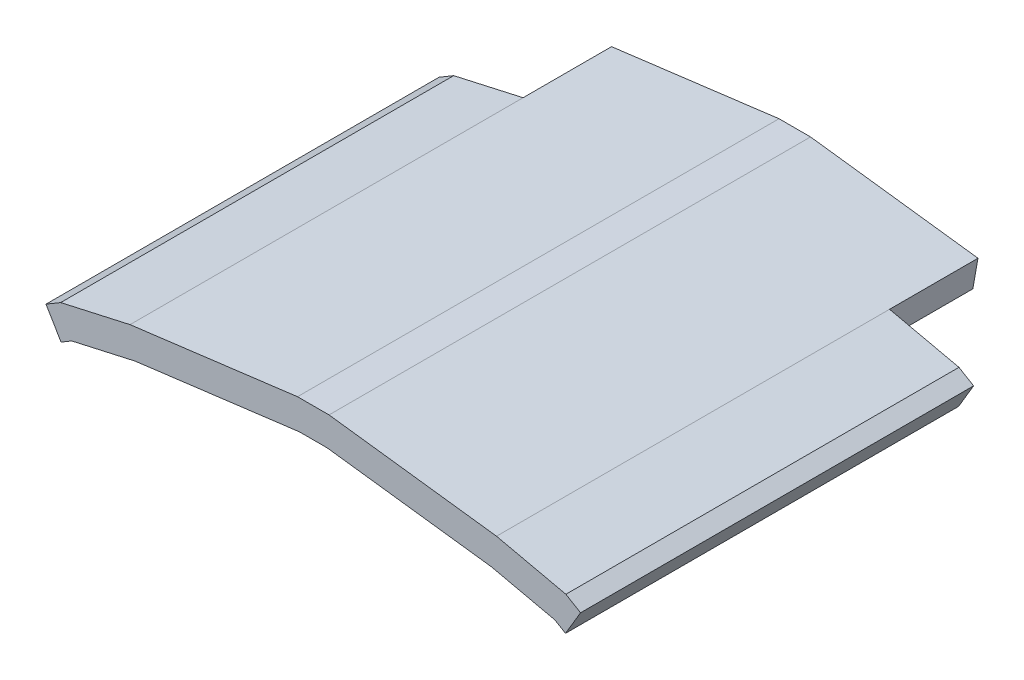
ISO-10303-21;
HEADER;
FILE_DESCRIPTION(('STEP AP214'),'2;1');
FILE_NAME('part.step','',(''),(''),'','','');
FILE_SCHEMA(('AUTOMOTIVE_DESIGN { 1 0 10303 214 1 1 1 1 }'));
ENDSEC;
DATA;
#1=APPLICATION_CONTEXT('core data for automotive mechanical design processes');
#2=APPLICATION_PROTOCOL_DEFINITION('international standard','automotive_design',2000,#1);
#3=PRODUCT_CONTEXT('',#1,'mechanical');
#4=PRODUCT('Part','Part','',(#3));
#5=PRODUCT_RELATED_PRODUCT_CATEGORY('part','',(#4));
#6=PRODUCT_DEFINITION_FORMATION('','',#4);
#7=PRODUCT_DEFINITION_CONTEXT('part definition',#1,'design');
#8=PRODUCT_DEFINITION('design','',#6,#7);
#9=PRODUCT_DEFINITION_SHAPE('','',#8);
#10=(LENGTH_UNIT() NAMED_UNIT(*) SI_UNIT(.MILLI.,.METRE.));
#11=(NAMED_UNIT(*) PLANE_ANGLE_UNIT() SI_UNIT($,.RADIAN.));
#12=(NAMED_UNIT(*) SI_UNIT($,.STERADIAN.) SOLID_ANGLE_UNIT());
#13=UNCERTAINTY_MEASURE_WITH_UNIT(LENGTH_MEASURE(1.E-05),#10,'distance_accuracy_value','');
#14=(GEOMETRIC_REPRESENTATION_CONTEXT(3) GLOBAL_UNCERTAINTY_ASSIGNED_CONTEXT((#13)) GLOBAL_UNIT_ASSIGNED_CONTEXT((#10,
#11,#12)) REPRESENTATION_CONTEXT('',''));
#15=CARTESIAN_POINT('',(0.,0.,0.));
#16=DIRECTION('',(0.,0.,1.));
#17=DIRECTION('',(1.,0.,0.));
#18=AXIS2_PLACEMENT_3D('',#15,#16,#17);
#19=CARTESIAN_POINT('',(0.,0.,0.));
#20=DIRECTION('',(0.,0.,1.));
#21=DIRECTION('',(1.,0.,0.));
#22=AXIS2_PLACEMENT_3D('',#19,#20,#21);
#23=PLANE('',#22);
#24=DIRECTION('',(-0.172858063942901,0.98494674461613,0.));
#25=VECTOR('',#24,1.);
#26=CARTESIAN_POINT('',(-23.6815385137267,-2.75466394746362,0.));
#27=LINE('',#26,#25);
#28=CARTESIAN_POINT('',(-23.0222169188532,-6.51148410217876,0.));
#29=VERTEX_POINT('',#28);
#30=CARTESIAN_POINT('',(-23.6815385137267,-2.75466394746362,0.));
#31=VERTEX_POINT('',#30);
#32=EDGE_CURVE('E587',#29,#31,#27,.T.);
#33=ORIENTED_EDGE('',*,*,#32,.F.);
#34=DIRECTION('',(0.975707484642978,0.219077393657294,0.));
#35=VECTOR('',#34,1.);
#36=CARTESIAN_POINT('',(-23.0222169188532,-6.51148410217876,0.));
#37=LINE('',#36,#35);
#38=CARTESIAN_POINT('',(-31.2251299014034,-8.3532992208485,0.));
#39=VERTEX_POINT('',#38);
#40=EDGE_CURVE('E200',#39,#29,#37,.T.);
#41=ORIENTED_EDGE('',*,*,#40,.F.);
#42=DIRECTION('',(0.859980344300152,0.510327157240717,0.));
#43=VECTOR('',#42,1.);
#44=CARTESIAN_POINT('',(-31.2251299014034,-8.3532992208485,0.));
#45=LINE('',#44,#43);
#46=CARTESIAN_POINT('',(-32.5996535309129,-9.16896523119041,0.));
#47=VERTEX_POINT('',#46);
#48=EDGE_CURVE('E197',#47,#39,#45,.T.);
#49=ORIENTED_EDGE('',*,*,#48,.F.);
#50=DIRECTION('',(0.51032715724072,-0.859980344300151,0.));
#51=VECTOR('',#50,1.);
#52=CARTESIAN_POINT('',(-34.544,-5.89244011940684,0.));
#53=LINE('',#52,#51);
#54=CARTESIAN_POINT('',(-34.544,-5.89244011940684,0.));
#55=VERTEX_POINT('',#54);
#56=EDGE_CURVE('E194',#55,#47,#53,.T.);
#57=ORIENTED_EDGE('',*,*,#56,.F.);
#58=DIRECTION('',(-0.859980344300151,-0.51032715724072,0.));
#59=VECTOR('',#58,1.);
#60=CARTESIAN_POINT('',(-32.6496237304414,-4.76828459330018,0.));
#61=LINE('',#60,#59);
#62=CARTESIAN_POINT('',(-32.6496237304414,-4.76828459330018,0.));
#63=VERTEX_POINT('',#62);
#64=EDGE_CURVE('E190',#63,#55,#61,.T.);
#65=ORIENTED_EDGE('',*,*,#64,.F.);
#66=DIRECTION('',(-0.975707484642978,-0.219077393657294,0.));
#67=VECTOR('',#66,1.);
#68=CARTESIAN_POINT('',(-23.6815385137267,-2.75466394746362,0.));
#69=LINE('',#68,#67);
#70=EDGE_CURVE('E187',#31,#63,#69,.T.);
#71=ORIENTED_EDGE('',*,*,#70,.F.);
#72=EDGE_LOOP('',(#33,#41,#49,#57,#65,#71));
#73=FACE_BOUND('',#72,.T.);
#74=ADVANCED_FACE('F39',(#73),#23,.F.);
#75=DIRECTION('',(-0.172858063942899,-0.98494674461613,0.));
#76=VECTOR('',#75,1.);
#77=CARTESIAN_POINT('',(23.6815385137267,-2.75466394746362,0.));
#78=LINE('',#77,#76);
#79=CARTESIAN_POINT('',(23.6815385137267,-2.75466394746362,0.));
#80=VERTEX_POINT('',#79);
#81=CARTESIAN_POINT('',(23.0222169188532,-6.51148410217876,0.));
#82=VERTEX_POINT('',#81);
#83=EDGE_CURVE('E96',#80,#82,#78,.T.);
#84=ORIENTED_EDGE('',*,*,#83,.F.);
#85=DIRECTION('',(-0.975707484642978,0.219077393657294,0.));
#86=VECTOR('',#85,1.);
#87=CARTESIAN_POINT('',(23.6815385137267,-2.75466394746362,0.));
#88=LINE('',#87,#86);
#89=CARTESIAN_POINT('',(32.6496237304414,-4.76828459330018,0.));
#90=VERTEX_POINT('',#89);
#91=EDGE_CURVE('E216',#90,#80,#88,.T.);
#92=ORIENTED_EDGE('',*,*,#91,.F.);
#93=DIRECTION('',(-0.859980344300151,0.51032715724072,0.));
#94=VECTOR('',#93,1.);
#95=CARTESIAN_POINT('',(32.6496237304414,-4.76828459330018,0.));
#96=LINE('',#95,#94);
#97=CARTESIAN_POINT('',(34.544,-5.89244011940684,0.));
#98=VERTEX_POINT('',#97);
#99=EDGE_CURVE('E213',#98,#90,#96,.T.);
#100=ORIENTED_EDGE('',*,*,#99,.F.);
#101=DIRECTION('',(0.51032715724072,0.859980344300151,0.));
#102=VECTOR('',#101,1.);
#103=CARTESIAN_POINT('',(34.544,-5.89244011940684,0.));
#104=LINE('',#103,#102);
#105=CARTESIAN_POINT('',(32.5996535309129,-9.16896523119041,0.));
#106=VERTEX_POINT('',#105);
#107=EDGE_CURVE('E210',#106,#98,#104,.T.);
#108=ORIENTED_EDGE('',*,*,#107,.F.);
#109=DIRECTION('',(0.859980344300152,-0.510327157240717,0.));
#110=VECTOR('',#109,1.);
#111=CARTESIAN_POINT('',(31.2251299014034,-8.3532992208485,0.));
#112=LINE('',#111,#110);
#113=CARTESIAN_POINT('',(31.2251299014034,-8.3532992208485,0.));
#114=VERTEX_POINT('',#113);
#115=EDGE_CURVE('E207',#114,#106,#112,.T.);
#116=ORIENTED_EDGE('',*,*,#115,.F.);
#117=DIRECTION('',(0.975707484642978,-0.219077393657294,0.));
#118=VECTOR('',#117,1.);
#119=CARTESIAN_POINT('',(23.0222169188532,-6.51148410217876,0.));
#120=LINE('',#119,#118);
#121=EDGE_CURVE('E204',#82,#114,#120,.T.);
#122=ORIENTED_EDGE('',*,*,#121,.F.);
#123=EDGE_LOOP('',(#84,#92,#100,#108,#116,#122));
#124=FACE_BOUND('',#123,.T.);
#125=ADVANCED_FACE('F357',(#124),#23,.F.);
#126=CARTESIAN_POINT('',(-23.6815385137267,-2.75466394746362,50.8));
#127=DIRECTION('',(0.219077393657294,-0.975707484642978,0.));
#128=DIRECTION('',(0.975707484642978,0.219077393657294,0.));
#129=AXIS2_PLACEMENT_3D('',#126,#127,#128);
#130=PLANE('',#129);
#131=ORIENTED_EDGE('',*,*,#70,.T.);
#132=DIRECTION('',(0.,0.,-1.));
#133=VECTOR('',#132,1.);
#134=CARTESIAN_POINT('',(-32.6496237304414,-4.76828459330018,50.8));
#135=LINE('',#134,#133);
#136=CARTESIAN_POINT('',(-32.6496237304414,-4.76828459330018,50.8));
#137=VERTEX_POINT('',#136);
#138=EDGE_CURVE('E11',#137,#63,#135,.T.);
#139=ORIENTED_EDGE('',*,*,#138,.F.);
#140=DIRECTION('',(-0.975707484642978,-0.219077393657294,0.));
#141=VECTOR('',#140,1.);
#142=CARTESIAN_POINT('',(-23.6815385137267,-2.75466394746362,50.8));
#143=LINE('',#142,#141);
#144=CARTESIAN_POINT('',(-23.6815385137267,-2.75466394746362,50.8));
#145=VERTEX_POINT('',#144);
#146=EDGE_CURVE('E219',#145,#137,#143,.T.);
#147=ORIENTED_EDGE('',*,*,#146,.F.);
#148=DIRECTION('',(0.,0.,-1.));
#149=VECTOR('',#148,1.);
#150=CARTESIAN_POINT('',(-23.6815385137267,-2.75466394746362,50.8));
#151=LINE('',#150,#149);
#152=EDGE_CURVE('E103',#145,#31,#151,.T.);
#153=ORIENTED_EDGE('',*,*,#152,.T.);
#154=EDGE_LOOP('',(#131,#139,#147,#153));
#155=FACE_BOUND('',#154,.T.);
#156=ADVANCED_FACE('F41',(#155),#130,.F.);
#157=CARTESIAN_POINT('',(-32.6496237304414,-4.76828459330018,50.8));
#158=DIRECTION('',(0.51032715724072,-0.859980344300151,0.));
#159=DIRECTION('',(0.859980344300151,0.51032715724072,0.));
#160=AXIS2_PLACEMENT_3D('',#157,#158,#159);
#161=PLANE('',#160);
#162=ORIENTED_EDGE('',*,*,#64,.T.);
#163=DIRECTION('',(0.,0.,-1.));
#164=VECTOR('',#163,1.);
#165=CARTESIAN_POINT('',(-34.544,-5.89244011940684,50.8));
#166=LINE('',#165,#164);
#167=CARTESIAN_POINT('',(-34.544,-5.89244011940684,50.8));
#168=VERTEX_POINT('',#167);
#169=EDGE_CURVE('E49',#168,#55,#166,.T.);
#170=ORIENTED_EDGE('',*,*,#169,.F.);
#171=DIRECTION('',(-0.859980344300151,-0.51032715724072,0.));
#172=VECTOR('',#171,1.);
#173=CARTESIAN_POINT('',(-32.6496237304414,-4.76828459330018,50.8));
#174=LINE('',#173,#172);
#175=EDGE_CURVE('E111',#137,#168,#174,.T.);
#176=ORIENTED_EDGE('',*,*,#175,.F.);
#177=ORIENTED_EDGE('',*,*,#138,.T.);
#178=EDGE_LOOP('',(#162,#170,#176,#177));
#179=FACE_BOUND('',#178,.T.);
#180=ADVANCED_FACE('F349',(#179),#161,.F.);
#181=CARTESIAN_POINT('',(-34.544,-5.89244011940684,50.8));
#182=DIRECTION('',(0.85998034430015,0.51032715724072,0.));
#183=DIRECTION('',(-0.51032715724072,0.85998034430015,0.));
#184=AXIS2_PLACEMENT_3D('',#181,#182,#183);
#185=PLANE('',#184);
#186=ORIENTED_EDGE('',*,*,#56,.T.);
#187=DIRECTION('',(0.,0.,-1.));
#188=VECTOR('',#187,1.);
#189=CARTESIAN_POINT('',(-32.5996535309129,-9.16896523119041,50.8));
#190=LINE('',#189,#188);
#191=CARTESIAN_POINT('',(-32.5996535309129,-9.16896523119041,50.8));
#192=VERTEX_POINT('',#191);
#193=EDGE_CURVE('E262',#192,#47,#190,.T.);
#194=ORIENTED_EDGE('',*,*,#193,.F.);
#195=DIRECTION('',(0.51032715724072,-0.859980344300151,0.));
#196=VECTOR('',#195,1.);
#197=CARTESIAN_POINT('',(-34.544,-5.89244011940684,50.8));
#198=LINE('',#197,#196);
#199=EDGE_CURVE('E272',#168,#192,#198,.T.);
#200=ORIENTED_EDGE('',*,*,#199,.F.);
#201=ORIENTED_EDGE('',*,*,#169,.T.);
#202=EDGE_LOOP('',(#186,#194,#200,#201));
#203=FACE_BOUND('',#202,.T.);
#204=ADVANCED_FACE('F270',(#203),#185,.F.);
#205=CARTESIAN_POINT('',(-31.2251299014034,-8.3532992208485,50.8));
#206=DIRECTION('',(-0.510327157240717,0.859980344300152,0.));
#207=DIRECTION('',(-0.859980344300152,-0.510327157240717,0.));
#208=AXIS2_PLACEMENT_3D('',#205,#206,#207);
#209=PLANE('',#208);
#210=ORIENTED_EDGE('',*,*,#48,.T.);
#211=DIRECTION('',(0.,0.,-1.));
#212=VECTOR('',#211,1.);
#213=CARTESIAN_POINT('',(-31.2251299014034,-8.3532992208485,50.8));
#214=LINE('',#213,#212);
#215=CARTESIAN_POINT('',(-31.2251299014034,-8.3532992208485,50.8));
#216=VERTEX_POINT('',#215);
#217=EDGE_CURVE('E258',#216,#39,#214,.T.);
#218=ORIENTED_EDGE('',*,*,#217,.F.);
#219=DIRECTION('',(0.859980344300152,0.510327157240717,0.));
#220=VECTOR('',#219,1.);
#221=CARTESIAN_POINT('',(-31.2251299014034,-8.3532992208485,50.8));
#222=LINE('',#221,#220);
#223=EDGE_CURVE('E288',#192,#216,#222,.T.);
#224=ORIENTED_EDGE('',*,*,#223,.F.);
#225=ORIENTED_EDGE('',*,*,#193,.T.);
#226=EDGE_LOOP('',(#210,#218,#224,#225));
#227=FACE_BOUND('',#226,.T.);
#228=ADVANCED_FACE('F278',(#227),#209,.F.);
#229=CARTESIAN_POINT('',(-23.0222169188532,-6.51148410217876,50.8));
#230=DIRECTION('',(-0.219077393657294,0.975707484642978,0.));
#231=DIRECTION('',(-0.975707484642978,-0.219077393657294,0.));
#232=AXIS2_PLACEMENT_3D('',#229,#230,#231);
#233=PLANE('',#232);
#234=ORIENTED_EDGE('',*,*,#40,.T.);
#235=DIRECTION('',(0.,0.,-1.));
#236=VECTOR('',#235,1.);
#237=CARTESIAN_POINT('',(-23.0222169188532,-6.51148410217876,50.8));
#238=LINE('',#237,#236);
#239=CARTESIAN_POINT('',(-23.0222169188532,-6.51148410217876,50.8));
#240=VERTEX_POINT('',#239);
#241=EDGE_CURVE('E254',#240,#29,#238,.T.);
#242=ORIENTED_EDGE('',*,*,#241,.F.);
#243=DIRECTION('',(0.975707484642978,0.219077393657294,0.));
#244=VECTOR('',#243,1.);
#245=CARTESIAN_POINT('',(-23.0222169188532,-6.51148410217876,50.8));
#246=LINE('',#245,#244);
#247=EDGE_CURVE('E284',#216,#240,#246,.T.);
#248=ORIENTED_EDGE('',*,*,#247,.F.);
#249=ORIENTED_EDGE('',*,*,#217,.T.);
#250=EDGE_LOOP('',(#234,#242,#248,#249));
#251=FACE_BOUND('',#250,.T.);
#252=ADVANCED_FACE('F282',(#251),#233,.F.);
#253=CARTESIAN_POINT('',(-1.79634467506948,-3.81,50.8));
#254=DIRECTION('',(-0.126254714419287,0.991997856392293,0.));
#255=DIRECTION('',(-0.991997856392293,-0.126254714419287,0.));
#256=AXIS2_PLACEMENT_3D('',#253,#254,#255);
#257=PLANE('',#256);
#258=ORIENTED_EDGE('',*,*,#241,.T.);
#259=DIRECTION('',(0.,0.,1.));
#260=VECTOR('',#259,1.);
#261=CARTESIAN_POINT('',(-23.0222169188532,-6.51148410217876,-11.43));
#262=LINE('',#261,#260);
#263=CARTESIAN_POINT('',(-23.0222169188532,-6.51148410217876,-11.43));
#264=VERTEX_POINT('',#263);
#265=EDGE_CURVE('E340',#264,#29,#262,.T.);
#266=ORIENTED_EDGE('',*,*,#265,.F.);
#267=DIRECTION('',(-0.991997856392293,-0.126254714419287,0.));
#268=VECTOR('',#267,1.);
#269=CARTESIAN_POINT('',(-23.0222169188532,-6.51148410217876,-11.43));
#270=LINE('',#269,#268);
#271=CARTESIAN_POINT('',(-1.79634467506948,-3.81,-11.43));
#272=VERTEX_POINT('',#271);
#273=EDGE_CURVE('E580',#272,#264,#270,.T.);
#274=ORIENTED_EDGE('',*,*,#273,.F.);
#275=DIRECTION('',(0.,0.,-1.));
#276=VECTOR('',#275,1.);
#277=CARTESIAN_POINT('',(-1.79634467506948,-3.81,50.8));
#278=LINE('',#277,#276);
#279=CARTESIAN_POINT('',(-1.79634467506948,-3.81,50.8));
#280=VERTEX_POINT('',#279);
#281=EDGE_CURVE('E250',#280,#272,#278,.T.);
#282=ORIENTED_EDGE('',*,*,#281,.F.);
#283=DIRECTION('',(0.991997856392293,0.126254714419287,0.));
#284=VECTOR('',#283,1.);
#285=CARTESIAN_POINT('',(-9.07969928707812,-4.73697564881622,50.8));
#286=LINE('',#285,#284);
#287=EDGE_CURVE('E287',#240,#280,#286,.T.);
#288=ORIENTED_EDGE('',*,*,#287,.F.);
#289=EDGE_LOOP('',(#258,#266,#274,#282,#288));
#290=FACE_BOUND('',#289,.T.);
#291=ADVANCED_FACE('F398',(#290),#257,.F.);
#292=CARTESIAN_POINT('',(-1.79634467506948,-3.81,50.8));
#293=DIRECTION('',(0.,1.,0.));
#294=DIRECTION('',(-1.,0.,0.));
#295=AXIS2_PLACEMENT_3D('',#292,#293,#294);
#296=PLANE('',#295);
#297=ORIENTED_EDGE('',*,*,#281,.T.);
#298=DIRECTION('',(-1.,0.,0.));
#299=VECTOR('',#298,1.);
#300=CARTESIAN_POINT('',(-1.79634467506948,-3.81,-11.43));
#301=LINE('',#300,#299);
#302=CARTESIAN_POINT('',(1.79634467506947,-3.81,-11.43));
#303=VERTEX_POINT('',#302);
#304=EDGE_CURVE('E602',#303,#272,#301,.T.);
#305=ORIENTED_EDGE('',*,*,#304,.F.);
#306=DIRECTION('',(0.,0.,-1.));
#307=VECTOR('',#306,1.);
#308=CARTESIAN_POINT('',(1.79634467506947,-3.81,50.8));
#309=LINE('',#308,#307);
#310=CARTESIAN_POINT('',(1.79634467506947,-3.81,50.8));
#311=VERTEX_POINT('',#310);
#312=EDGE_CURVE('E246',#311,#303,#309,.T.);
#313=ORIENTED_EDGE('',*,*,#312,.F.);
#314=DIRECTION('',(1.,0.,0.));
#315=VECTOR('',#314,1.);
#316=CARTESIAN_POINT('',(-1.79634467506948,-3.81,50.8));
#317=LINE('',#316,#315);
#318=EDGE_CURVE('E292',#280,#311,#317,.T.);
#319=ORIENTED_EDGE('',*,*,#318,.F.);
#320=EDGE_LOOP('',(#297,#305,#313,#319));
#321=FACE_BOUND('',#320,.T.);
#322=ADVANCED_FACE('F394',(#321),#296,.F.);
#323=CARTESIAN_POINT('',(9.07969928707812,-4.73697564881622,50.8));
#324=DIRECTION('',(0.126254714419287,0.991997856392293,0.));
#325=DIRECTION('',(-0.991997856392293,0.126254714419287,0.));
#326=AXIS2_PLACEMENT_3D('',#323,#324,#325);
#327=PLANE('',#326);
#328=ORIENTED_EDGE('',*,*,#312,.T.);
#329=DIRECTION('',(-0.991997856392293,0.126254714419287,0.));
#330=VECTOR('',#329,1.);
#331=CARTESIAN_POINT('',(1.79634467506947,-3.81,-11.43));
#332=LINE('',#331,#330);
#333=CARTESIAN_POINT('',(23.0222169188532,-6.51148410217876,-11.43));
#334=VERTEX_POINT('',#333);
#335=EDGE_CURVE('E598',#334,#303,#332,.T.);
#336=ORIENTED_EDGE('',*,*,#335,.F.);
#337=DIRECTION('',(0.,0.,1.));
#338=VECTOR('',#337,1.);
#339=CARTESIAN_POINT('',(23.0222169188532,-6.51148410217876,-11.43));
#340=LINE('',#339,#338);
#341=EDGE_CURVE('E334',#334,#82,#340,.T.);
#342=ORIENTED_EDGE('',*,*,#341,.T.);
#343=DIRECTION('',(0.,0.,-1.));
#344=VECTOR('',#343,1.);
#345=CARTESIAN_POINT('',(23.0222169188532,-6.51148410217876,50.8));
#346=LINE('',#345,#344);
#347=CARTESIAN_POINT('',(23.0222169188532,-6.51148410217876,50.8));
#348=VERTEX_POINT('',#347);
#349=EDGE_CURVE('E242',#348,#82,#346,.T.);
#350=ORIENTED_EDGE('',*,*,#349,.F.);
#351=DIRECTION('',(0.991997856392293,-0.126254714419287,0.));
#352=VECTOR('',#351,1.);
#353=CARTESIAN_POINT('',(1.79634467506947,-3.81,50.8));
#354=LINE('',#353,#352);
#355=EDGE_CURVE('E299',#311,#348,#354,.T.);
#356=ORIENTED_EDGE('',*,*,#355,.F.);
#357=EDGE_LOOP('',(#328,#336,#342,#350,#356));
#358=FACE_BOUND('',#357,.T.);
#359=ADVANCED_FACE('F390',(#358),#327,.F.);
#360=CARTESIAN_POINT('',(23.0222169188532,-6.51148410217876,50.8));
#361=DIRECTION('',(0.219077393657294,0.975707484642978,0.));
#362=DIRECTION('',(-0.975707484642978,0.219077393657294,0.));
#363=AXIS2_PLACEMENT_3D('',#360,#361,#362);
#364=PLANE('',#363);
#365=ORIENTED_EDGE('',*,*,#121,.T.);
#366=DIRECTION('',(0.,0.,-1.));
#367=VECTOR('',#366,1.);
#368=CARTESIAN_POINT('',(31.2251299014034,-8.3532992208485,50.8));
#369=LINE('',#368,#367);
#370=CARTESIAN_POINT('',(31.2251299014034,-8.3532992208485,50.8));
#371=VERTEX_POINT('',#370);
#372=EDGE_CURVE('E238',#371,#114,#369,.T.);
#373=ORIENTED_EDGE('',*,*,#372,.F.);
#374=DIRECTION('',(0.975707484642978,-0.219077393657294,0.));
#375=VECTOR('',#374,1.);
#376=CARTESIAN_POINT('',(23.0222169188532,-6.51148410217876,50.8));
#377=LINE('',#376,#375);
#378=EDGE_CURVE('E302',#348,#371,#377,.T.);
#379=ORIENTED_EDGE('',*,*,#378,.F.);
#380=ORIENTED_EDGE('',*,*,#349,.T.);
#381=EDGE_LOOP('',(#365,#373,#379,#380));
#382=FACE_BOUND('',#381,.T.);
#383=ADVANCED_FACE('F386',(#382),#364,.F.);
#384=CARTESIAN_POINT('',(31.2251299014034,-8.3532992208485,50.8));
#385=DIRECTION('',(0.510327157240717,0.859980344300152,0.));
#386=DIRECTION('',(-0.859980344300152,0.510327157240717,0.));
#387=AXIS2_PLACEMENT_3D('',#384,#385,#386);
#388=PLANE('',#387);
#389=ORIENTED_EDGE('',*,*,#115,.T.);
#390=DIRECTION('',(0.,0.,-1.));
#391=VECTOR('',#390,1.);
#392=CARTESIAN_POINT('',(32.5996535309129,-9.16896523119041,50.8));
#393=LINE('',#392,#391);
#394=CARTESIAN_POINT('',(32.5996535309129,-9.16896523119041,50.8));
#395=VERTEX_POINT('',#394);
#396=EDGE_CURVE('E234',#395,#106,#393,.T.);
#397=ORIENTED_EDGE('',*,*,#396,.F.);
#398=DIRECTION('',(0.859980344300152,-0.510327157240717,0.));
#399=VECTOR('',#398,1.);
#400=CARTESIAN_POINT('',(31.2251299014034,-8.3532992208485,50.8));
#401=LINE('',#400,#399);
#402=EDGE_CURVE('E305',#371,#395,#401,.T.);
#403=ORIENTED_EDGE('',*,*,#402,.F.);
#404=ORIENTED_EDGE('',*,*,#372,.T.);
#405=EDGE_LOOP('',(#389,#397,#403,#404));
#406=FACE_BOUND('',#405,.T.);
#407=ADVANCED_FACE('F382',(#406),#388,.F.);
#408=CARTESIAN_POINT('',(34.544,-5.89244011940684,50.8));
#409=DIRECTION('',(-0.85998034430015,0.51032715724072,0.));
#410=DIRECTION('',(-0.51032715724072,-0.85998034430015,0.));
#411=AXIS2_PLACEMENT_3D('',#408,#409,#410);
#412=PLANE('',#411);
#413=ORIENTED_EDGE('',*,*,#107,.T.);
#414=DIRECTION('',(0.,0.,-1.));
#415=VECTOR('',#414,1.);
#416=CARTESIAN_POINT('',(34.544,-5.89244011940684,50.8));
#417=LINE('',#416,#415);
#418=CARTESIAN_POINT('',(34.544,-5.89244011940684,50.8));
#419=VERTEX_POINT('',#418);
#420=EDGE_CURVE('E230',#419,#98,#417,.T.);
#421=ORIENTED_EDGE('',*,*,#420,.F.);
#422=DIRECTION('',(0.51032715724072,0.859980344300151,0.));
#423=VECTOR('',#422,1.);
#424=CARTESIAN_POINT('',(34.544,-5.89244011940684,50.8));
#425=LINE('',#424,#423);
#426=EDGE_CURVE('E308',#395,#419,#425,.T.);
#427=ORIENTED_EDGE('',*,*,#426,.F.);
#428=ORIENTED_EDGE('',*,*,#396,.T.);
#429=EDGE_LOOP('',(#413,#421,#427,#428));
#430=FACE_BOUND('',#429,.T.);
#431=ADVANCED_FACE('F379',(#430),#412,.F.);
#432=CARTESIAN_POINT('',(32.6496237304414,-4.76828459330018,50.8));
#433=DIRECTION('',(-0.51032715724072,-0.859980344300151,0.));
#434=DIRECTION('',(0.859980344300151,-0.51032715724072,0.));
#435=AXIS2_PLACEMENT_3D('',#432,#433,#434);
#436=PLANE('',#435);
#437=ORIENTED_EDGE('',*,*,#99,.T.);
#438=DIRECTION('',(0.,0.,-1.));
#439=VECTOR('',#438,1.);
#440=CARTESIAN_POINT('',(32.6496237304414,-4.76828459330018,50.8));
#441=LINE('',#440,#439);
#442=CARTESIAN_POINT('',(32.6496237304414,-4.76828459330018,50.8));
#443=VERTEX_POINT('',#442);
#444=EDGE_CURVE('E226',#443,#90,#441,.T.);
#445=ORIENTED_EDGE('',*,*,#444,.F.);
#446=DIRECTION('',(-0.859980344300151,0.51032715724072,0.));
#447=VECTOR('',#446,1.);
#448=CARTESIAN_POINT('',(32.6496237304414,-4.76828459330018,50.8));
#449=LINE('',#448,#447);
#450=EDGE_CURVE('E311',#419,#443,#449,.T.);
#451=ORIENTED_EDGE('',*,*,#450,.F.);
#452=ORIENTED_EDGE('',*,*,#420,.T.);
#453=EDGE_LOOP('',(#437,#445,#451,#452));
#454=FACE_BOUND('',#453,.T.);
#455=ADVANCED_FACE('F319',(#454),#436,.F.);
#456=CARTESIAN_POINT('',(23.6815385137267,-2.75466394746362,50.8));
#457=DIRECTION('',(-0.219077393657294,-0.975707484642978,0.));
#458=DIRECTION('',(0.975707484642978,-0.219077393657294,0.));
#459=AXIS2_PLACEMENT_3D('',#456,#457,#458);
#460=PLANE('',#459);
#461=ORIENTED_EDGE('',*,*,#91,.T.);
#462=DIRECTION('',(0.,0.,-1.));
#463=VECTOR('',#462,1.);
#464=CARTESIAN_POINT('',(23.6815385137267,-2.75466394746362,50.8));
#465=LINE('',#464,#463);
#466=CARTESIAN_POINT('',(23.6815385137267,-2.75466394746362,50.8));
#467=VERTEX_POINT('',#466);
#468=EDGE_CURVE('E176',#467,#80,#465,.T.);
#469=ORIENTED_EDGE('',*,*,#468,.F.);
#470=DIRECTION('',(-0.975707484642978,0.219077393657294,0.));
#471=VECTOR('',#470,1.);
#472=CARTESIAN_POINT('',(23.6815385137267,-2.75466394746362,50.8));
#473=LINE('',#472,#471);
#474=EDGE_CURVE('E158',#443,#467,#473,.T.);
#475=ORIENTED_EDGE('',*,*,#474,.F.);
#476=ORIENTED_EDGE('',*,*,#444,.T.);
#477=EDGE_LOOP('',(#461,#469,#475,#476));
#478=FACE_BOUND('',#477,.T.);
#479=ADVANCED_FACE('F322',(#478),#460,.F.);
#480=CARTESIAN_POINT('',(2.03782609052073,0.,50.8));
#481=DIRECTION('',(-0.126254714419287,-0.991997856392293,0.));
#482=DIRECTION('',(0.991997856392293,-0.126254714419287,0.));
#483=AXIS2_PLACEMENT_3D('',#480,#481,#482);
#484=PLANE('',#483);
#485=ORIENTED_EDGE('',*,*,#468,.T.);
#486=DIRECTION('',(0.,0.,1.));
#487=VECTOR('',#486,1.);
#488=CARTESIAN_POINT('',(23.6815385137267,-2.75466394746362,-11.43));
#489=LINE('',#488,#487);
#490=CARTESIAN_POINT('',(23.6815385137267,-2.75466394746362,-11.43));
#491=VERTEX_POINT('',#490);
#492=EDGE_CURVE('E325',#491,#80,#489,.T.);
#493=ORIENTED_EDGE('',*,*,#492,.F.);
#494=DIRECTION('',(0.991997856392293,-0.126254714419287,0.));
#495=VECTOR('',#494,1.);
#496=CARTESIAN_POINT('',(23.6815385137267,-2.75466394746362,-11.43));
#497=LINE('',#496,#495);
#498=CARTESIAN_POINT('',(2.03782609052073,0.,-11.43));
#499=VERTEX_POINT('',#498);
#500=EDGE_CURVE('E171',#499,#491,#497,.T.);
#501=ORIENTED_EDGE('',*,*,#500,.F.);
#502=DIRECTION('',(0.,0.,-1.));
#503=VECTOR('',#502,1.);
#504=CARTESIAN_POINT('',(2.03782609052073,0.,50.8));
#505=LINE('',#504,#503);
#506=CARTESIAN_POINT('',(2.03782609052073,0.,50.8));
#507=VERTEX_POINT('',#506);
#508=EDGE_CURVE('E166',#507,#499,#505,.T.);
#509=ORIENTED_EDGE('',*,*,#508,.F.);
#510=DIRECTION('',(-0.991997856392293,0.126254714419287,0.));
#511=VECTOR('',#510,1.);
#512=CARTESIAN_POINT('',(9.5607297490156,-0.957463815961586,50.8));
#513=LINE('',#512,#511);
#514=EDGE_CURVE('E151',#467,#507,#513,.T.);
#515=ORIENTED_EDGE('',*,*,#514,.F.);
#516=EDGE_LOOP('',(#485,#493,#501,#509,#515));
#517=FACE_BOUND('',#516,.T.);
#518=ADVANCED_FACE('F167',(#517),#484,.F.);
#519=CARTESIAN_POINT('',(-2.03782609052073,0.,50.8));
#520=DIRECTION('',(0.,-1.,0.));
#521=DIRECTION('',(0.,0.,-1.));
#522=AXIS2_PLACEMENT_3D('',#519,#520,#521);
#523=PLANE('',#522);
#524=ORIENTED_EDGE('',*,*,#508,.T.);
#525=DIRECTION('',(1.,0.,0.));
#526=VECTOR('',#525,1.);
#527=CARTESIAN_POINT('',(2.03782609052073,0.,-11.43));
#528=LINE('',#527,#526);
#529=CARTESIAN_POINT('',(-2.03782609052073,0.,-11.43));
#530=VERTEX_POINT('',#529);
#531=EDGE_CURVE('E589',#530,#499,#528,.T.);
#532=ORIENTED_EDGE('',*,*,#531,.F.);
#533=DIRECTION('',(0.,0.,-1.));
#534=VECTOR('',#533,1.);
#535=CARTESIAN_POINT('',(-2.03782609052073,0.,50.8));
#536=LINE('',#535,#534);
#537=CARTESIAN_POINT('',(-2.03782609052073,0.,50.8));
#538=VERTEX_POINT('',#537);
#539=EDGE_CURVE('E177',#538,#530,#536,.T.);
#540=ORIENTED_EDGE('',*,*,#539,.F.);
#541=DIRECTION('',(-1.,0.,0.));
#542=VECTOR('',#541,1.);
#543=CARTESIAN_POINT('',(-2.03782609052073,0.,50.8));
#544=LINE('',#543,#542);
#545=EDGE_CURVE('E155',#507,#538,#544,.T.);
#546=ORIENTED_EDGE('',*,*,#545,.F.);
#547=EDGE_LOOP('',(#524,#532,#540,#546));
#548=FACE_BOUND('',#547,.T.);
#549=ADVANCED_FACE('F179',(#548),#523,.F.);
#550=CARTESIAN_POINT('',(-9.5607297490156,-0.957463815961586,50.8));
#551=DIRECTION('',(0.126254714419287,-0.991997856392293,0.));
#552=DIRECTION('',(0.991997856392293,0.126254714419287,0.));
#553=AXIS2_PLACEMENT_3D('',#550,#551,#552);
#554=PLANE('',#553);
#555=ORIENTED_EDGE('',*,*,#539,.T.);
#556=DIRECTION('',(0.991997856392293,0.126254714419287,0.));
#557=VECTOR('',#556,1.);
#558=CARTESIAN_POINT('',(-2.03782609052073,0.,-11.43));
#559=LINE('',#558,#557);
#560=CARTESIAN_POINT('',(-23.6815385137267,-2.75466394746362,-11.43));
#561=VERTEX_POINT('',#560);
#562=EDGE_CURVE('E577',#561,#530,#559,.T.);
#563=ORIENTED_EDGE('',*,*,#562,.F.);
#564=DIRECTION('',(0.,0.,1.));
#565=VECTOR('',#564,1.);
#566=CARTESIAN_POINT('',(-23.6815385137267,-2.75466394746362,-11.43));
#567=LINE('',#566,#565);
#568=EDGE_CURVE('E191',#561,#31,#567,.T.);
#569=ORIENTED_EDGE('',*,*,#568,.T.);
#570=ORIENTED_EDGE('',*,*,#152,.F.);
#571=DIRECTION('',(-0.991997856392293,-0.126254714419287,0.));
#572=VECTOR('',#571,1.);
#573=CARTESIAN_POINT('',(-2.03782609052073,0.,50.8));
#574=LINE('',#573,#572);
#575=EDGE_CURVE('E57',#538,#145,#574,.T.);
#576=ORIENTED_EDGE('',*,*,#575,.F.);
#577=EDGE_LOOP('',(#555,#563,#569,#570,#576));
#578=FACE_BOUND('',#577,.T.);
#579=ADVANCED_FACE('F367',(#578),#554,.F.);
#580=CARTESIAN_POINT('',(0.,0.,50.8));
#581=DIRECTION('',(0.,0.,1.));
#582=DIRECTION('',(1.,0.,0.));
#583=AXIS2_PLACEMENT_3D('',#580,#581,#582);
#584=PLANE('',#583);
#585=ORIENTED_EDGE('',*,*,#146,.T.);
#586=ORIENTED_EDGE('',*,*,#175,.T.);
#587=ORIENTED_EDGE('',*,*,#199,.T.);
#588=ORIENTED_EDGE('',*,*,#223,.T.);
#589=ORIENTED_EDGE('',*,*,#247,.T.);
#590=ORIENTED_EDGE('',*,*,#287,.T.);
#591=ORIENTED_EDGE('',*,*,#318,.T.);
#592=ORIENTED_EDGE('',*,*,#355,.T.);
#593=ORIENTED_EDGE('',*,*,#378,.T.);
#594=ORIENTED_EDGE('',*,*,#402,.T.);
#595=ORIENTED_EDGE('',*,*,#426,.T.);
#596=ORIENTED_EDGE('',*,*,#450,.T.);
#597=ORIENTED_EDGE('',*,*,#474,.T.);
#598=ORIENTED_EDGE('',*,*,#514,.T.);
#599=ORIENTED_EDGE('',*,*,#545,.T.);
#600=ORIENTED_EDGE('',*,*,#575,.T.);
#601=EDGE_LOOP('',(#585,#586,#587,#588,#589,#590,#591,#592,#593,#594,#595,#596,#597,#598,#599,#600));
#602=FACE_BOUND('',#601,.T.);
#603=ADVANCED_FACE('F153',(#602),#584,.T.);
#604=CARTESIAN_POINT('',(-23.6815385137267,-2.75466394746362,-11.43));
#605=DIRECTION('',(0.98494674461613,0.172858063942901,0.));
#606=DIRECTION('',(-0.172858063942901,0.98494674461613,0.));
#607=AXIS2_PLACEMENT_3D('',#604,#605,#606);
#608=PLANE('',#607);
#609=ORIENTED_EDGE('',*,*,#32,.T.);
#610=ORIENTED_EDGE('',*,*,#568,.F.);
#611=DIRECTION('',(-0.172858063942901,0.98494674461613,0.));
#612=VECTOR('',#611,1.);
#613=CARTESIAN_POINT('',(-23.6815385137267,-2.75466394746362,-11.43));
#614=LINE('',#613,#612);
#615=EDGE_CURVE('E573',#264,#561,#614,.T.);
#616=ORIENTED_EDGE('',*,*,#615,.F.);
#617=ORIENTED_EDGE('',*,*,#265,.T.);
#618=EDGE_LOOP('',(#609,#610,#616,#617));
#619=FACE_BOUND('',#618,.T.);
#620=ADVANCED_FACE('F448',(#619),#608,.F.);
#621=CARTESIAN_POINT('',(23.6815385137267,-2.75466394746362,-11.43));
#622=DIRECTION('',(-0.98494674461613,0.172858063942899,0.));
#623=DIRECTION('',(-0.172858063942899,-0.98494674461613,0.));
#624=AXIS2_PLACEMENT_3D('',#621,#622,#623);
#625=PLANE('',#624);
#626=ORIENTED_EDGE('',*,*,#83,.T.);
#627=ORIENTED_EDGE('',*,*,#341,.F.);
#628=DIRECTION('',(-0.172858063942899,-0.98494674461613,0.));
#629=VECTOR('',#628,1.);
#630=CARTESIAN_POINT('',(23.6815385137267,-2.75466394746362,-11.43));
#631=LINE('',#630,#629);
#632=EDGE_CURVE('E332',#491,#334,#631,.T.);
#633=ORIENTED_EDGE('',*,*,#632,.F.);
#634=ORIENTED_EDGE('',*,*,#492,.T.);
#635=EDGE_LOOP('',(#626,#627,#633,#634));
#636=FACE_BOUND('',#635,.T.);
#637=ADVANCED_FACE('F328',(#636),#625,.F.);
#638=CARTESIAN_POINT('',(0.,0.,-11.43));
#639=DIRECTION('',(0.,0.,1.));
#640=DIRECTION('',(1.,0.,0.));
#641=AXIS2_PLACEMENT_3D('',#638,#639,#640);
#642=PLANE('',#641);
#643=ORIENTED_EDGE('',*,*,#615,.T.);
#644=ORIENTED_EDGE('',*,*,#562,.T.);
#645=ORIENTED_EDGE('',*,*,#531,.T.);
#646=ORIENTED_EDGE('',*,*,#500,.T.);
#647=ORIENTED_EDGE('',*,*,#632,.T.);
#648=ORIENTED_EDGE('',*,*,#335,.T.);
#649=ORIENTED_EDGE('',*,*,#304,.T.);
#650=ORIENTED_EDGE('',*,*,#273,.T.);
#651=EDGE_LOOP('',(#643,#644,#645,#646,#647,#648,#649,#650));
#652=FACE_BOUND('',#651,.T.);
#653=ADVANCED_FACE('F490',(#652),#642,.F.);
#654=CLOSED_SHELL('',(#74,#125,#156,#180,#204,#228,#252,#291,#322,#359,#383,#407,#431,#455,#479,
#518,#549,#579,#603,#620,#637,#653));
#655=MANIFOLD_SOLID_BREP('B2',#654);
#656=ADVANCED_BREP_SHAPE_REPRESENTATION('',(#18,#655),#14);
#657=SHAPE_DEFINITION_REPRESENTATION(#9,#656);
ENDSEC;
END-ISO-10303-21;
